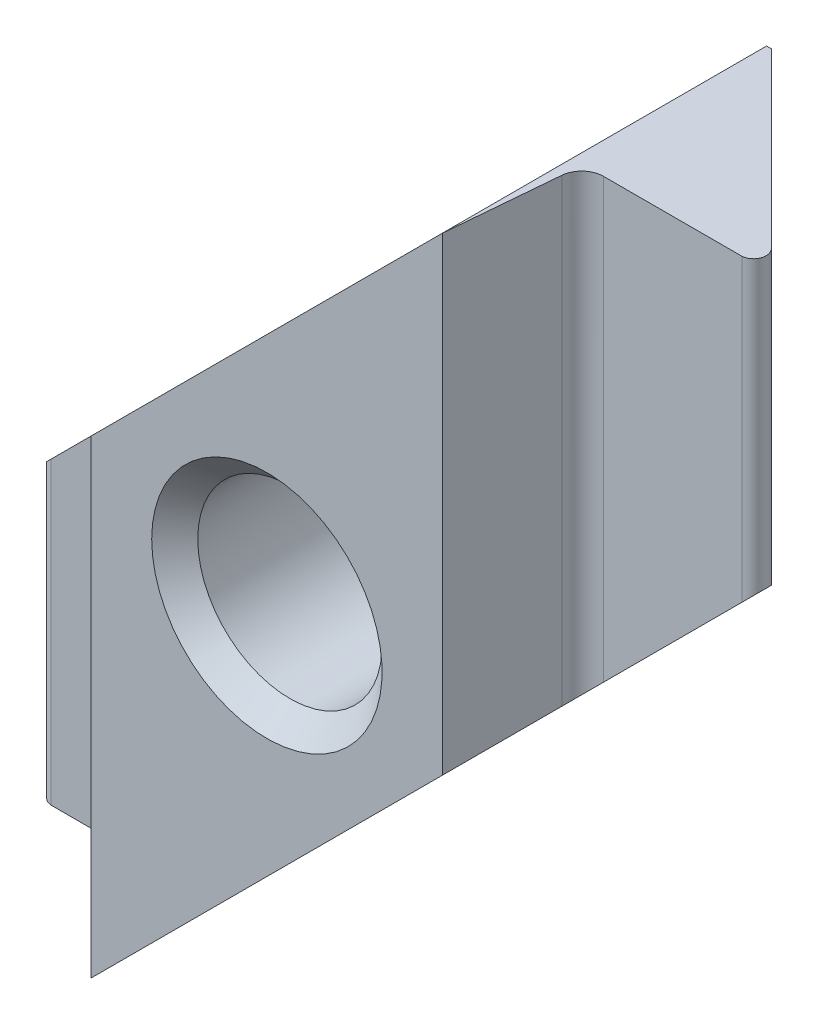
ISO-10303-21;
HEADER;
FILE_DESCRIPTION(('STEP AP214'),'2;1');
FILE_NAME('part.step','',(''),(''),'','','');
FILE_SCHEMA(('AUTOMOTIVE_DESIGN { 1 0 10303 214 1 1 1 1 }'));
ENDSEC;
DATA;
#1=APPLICATION_CONTEXT('core data for automotive mechanical design processes');
#2=APPLICATION_PROTOCOL_DEFINITION('international standard','automotive_design',2000,#1);
#3=PRODUCT_CONTEXT('',#1,'mechanical');
#4=PRODUCT('Part','Part','',(#3));
#5=PRODUCT_RELATED_PRODUCT_CATEGORY('part','',(#4));
#6=PRODUCT_DEFINITION_FORMATION('','',#4);
#7=PRODUCT_DEFINITION_CONTEXT('part definition',#1,'design');
#8=PRODUCT_DEFINITION('design','',#6,#7);
#9=PRODUCT_DEFINITION_SHAPE('','',#8);
#10=(LENGTH_UNIT() NAMED_UNIT(*) SI_UNIT(.MILLI.,.METRE.));
#11=(NAMED_UNIT(*) PLANE_ANGLE_UNIT() SI_UNIT($,.RADIAN.));
#12=(NAMED_UNIT(*) SI_UNIT($,.STERADIAN.) SOLID_ANGLE_UNIT());
#13=UNCERTAINTY_MEASURE_WITH_UNIT(LENGTH_MEASURE(1.E-05),#10,'distance_accuracy_value','');
#14=(GEOMETRIC_REPRESENTATION_CONTEXT(3) GLOBAL_UNCERTAINTY_ASSIGNED_CONTEXT((#13)) GLOBAL_UNIT_ASSIGNED_CONTEXT((#10,
#11,#12)) REPRESENTATION_CONTEXT('',''));
#15=CARTESIAN_POINT('',(0.,0.,0.));
#16=DIRECTION('',(0.,0.,1.));
#17=DIRECTION('',(1.,0.,0.));
#18=AXIS2_PLACEMENT_3D('',#15,#16,#17);
#19=CARTESIAN_POINT('',(-5.99967419969696,7.125,-3.66853808442258E-09));
#20=DIRECTION('',(0.,0.,1.));
#21=DIRECTION('',(1.,0.,0.));
#22=AXIS2_PLACEMENT_3D('',#19,#20,#21);
#23=PLANE('',#22);
#24=DIRECTION('',(1.,0.,0.));
#25=VECTOR('',#24,1.);
#26=CARTESIAN_POINT('',(-5.54445747646959E-09,7.125,0.));
#27=LINE('',#26,#25);
#28=CARTESIAN_POINT('',(5.99967418,7.125,1.04265318709613E-09));
#29=VERTEX_POINT('',#28);
#30=CARTESIAN_POINT('',(3.59047368385637,7.125,0.));
#31=VERTEX_POINT('',#30);
#32=EDGE_CURVE('E217',#29,#31,#27,.F.);
#33=ORIENTED_EDGE('',*,*,#32,.T.);
#34=DIRECTION('',(0.,-1.,0.));
#35=VECTOR('',#34,1.);
#36=CARTESIAN_POINT('',(3.59047368385637,7.125,-3.66853808442258E-09));
#37=LINE('',#36,#35);
#38=CARTESIAN_POINT('',(3.59047368385637,-0.48452631614363,0.));
#39=VERTEX_POINT('',#38);
#40=EDGE_CURVE('E61',#31,#39,#37,.T.);
#41=ORIENTED_EDGE('',*,*,#40,.T.);
#42=DIRECTION('',(0.707106781186547,0.707106781186548,0.));
#43=VECTOR('',#42,1.);
#44=CARTESIAN_POINT('',(2.25330085889911,-1.82169914110089,0.));
#45=LINE('',#44,#43);
#46=CARTESIAN_POINT('',(5.99967418,1.92467418000001,1.04265319130624E-09));
#47=VERTEX_POINT('',#46);
#48=EDGE_CURVE('E287',#47,#39,#45,.F.);
#49=ORIENTED_EDGE('',*,*,#48,.F.);
#50=DIRECTION('',(0.,1.,0.));
#51=VECTOR('',#50,1.);
#52=CARTESIAN_POINT('',(5.99967418,7.125,2.08530648304617E-09));
#53=LINE('',#52,#51);
#54=EDGE_CURVE('E337',#47,#29,#53,.T.);
#55=ORIENTED_EDGE('',*,*,#54,.T.);
#56=EDGE_LOOP('',(#33,#41,#49,#55));
#57=FACE_BOUND('',#56,.T.);
#58=ADVANCED_FACE('F40',(#57),#23,.T.);
#59=CARTESIAN_POINT('',(2.25330085889911,-1.82169914110089,0.));
#60=DIRECTION('',(0.707106781186548,-0.707106781186547,0.));
#61=DIRECTION('',(0.707106781186547,0.707106781186548,0.));
#62=AXIS2_PLACEMENT_3D('',#59,#60,#61);
#63=PLANE('',#62);
#64=ORIENTED_EDGE('',*,*,#48,.T.);
#65=CARTESIAN_POINT('',(3.59047368385637,-0.48452631614363,0.374999994246156));
#66=DIRECTION('',(0.707106781186548,-0.707106781186547,0.));
#67=DIRECTION('',(-0.707106781186547,-0.707106781186548,0.));
#68=AXIS2_PLACEMENT_3D('',#65,#66,#67);
#69=ELLIPSE('',#68,0.530330082940843,0.374999997914694);
#70=CARTESIAN_POINT('',(3.21690067413069,-0.858099325869309,0.342316591110638));
#71=VERTEX_POINT('',#70);
#72=EDGE_CURVE('E12',#39,#71,#69,.F.);
#73=ORIENTED_EDGE('',*,*,#72,.T.);
#74=DIRECTION('',(-0.0868265933023741,-0.0868265933023742,0.992432509237282));
#75=VECTOR('',#74,1.);
#76=CARTESIAN_POINT('',(3.23186905220776,-0.843130947792237,0.171227245678093));
#77=LINE('',#76,#75);
#78=CARTESIAN_POINT('',(3.05000000345213,-1.02500000034623,2.24999999886647));
#79=VERTEX_POINT('',#78);
#80=EDGE_CURVE('E183',#79,#71,#77,.F.);
#81=ORIENTED_EDGE('',*,*,#80,.F.);
#82=DIRECTION('',(0.707106782215891,0.707106780157204,0.));
#83=VECTOR('',#82,1.);
#84=CARTESIAN_POINT('',(3.05000000345213,-1.02500000034623,2.24999999886647));
#85=LINE('',#84,#83);
#86=CARTESIAN_POINT('',(-3.05000001,-7.12500001,2.25000006975162));
#87=VERTEX_POINT('',#86);
#88=EDGE_CURVE('E172',#87,#79,#85,.T.);
#89=ORIENTED_EDGE('',*,*,#88,.F.);
#90=DIRECTION('',(0.,0.,1.));
#91=VECTOR('',#90,1.);
#92=CARTESIAN_POINT('',(-3.05000001,-7.12500001,0.));
#93=LINE('',#92,#91);
#94=CARTESIAN_POINT('',(-3.05000000444444,-7.12500000444444,-3.375));
#95=VERTEX_POINT('',#94);
#96=EDGE_CURVE('E264',#87,#95,#93,.F.);
#97=ORIENTED_EDGE('',*,*,#96,.T.);
#98=DIRECTION('',(-0.707106781186547,-0.707106781186548,0.));
#99=VECTOR('',#98,1.);
#100=CARTESIAN_POINT('',(3.13229081,-0.942709189999997,-3.375));
#101=LINE('',#100,#99);
#102=CARTESIAN_POINT('',(3.13229081061589,-0.942709189384104,-3.375));
#103=VERTEX_POINT('',#102);
#104=EDGE_CURVE('E210',#103,#95,#101,.T.);
#105=ORIENTED_EDGE('',*,*,#104,.F.);
#106=DIRECTION('',(0.577327230017242,0.577327230017243,0.577396344776477));
#107=VECTOR('',#106,1.);
#108=CARTESIAN_POINT('',(3.13229081,-0.942709189999998,-3.375));
#109=LINE('',#108,#107);
#110=CARTESIAN_POINT('',(6.14824589800071,2.07324589800072,-0.358683856779772));
#111=VERTEX_POINT('',#110);
#112=EDGE_CURVE('E292',#103,#111,#109,.T.);
#113=ORIENTED_EDGE('',*,*,#112,.T.);
#114=CARTESIAN_POINT('',(5.98170294,1.90670294000001,-0.21755607));
#115=DIRECTION('',(0.707106781186548,-0.707106781186547,0.));
#116=DIRECTION('',(0.707106781186547,0.707106781186548,0.));
#117=AXIS2_PLACEMENT_3D('',#114,#115,#116);
#118=ELLIPSE('',#117,0.308718671482574,0.21829706608423);
#119=EDGE_CURVE('E377',#47,#111,#118,.F.);
#120=ORIENTED_EDGE('',*,*,#119,.F.);
#121=EDGE_LOOP('',(#64,#73,#81,#89,#97,#105,#113,#120));
#122=FACE_BOUND('',#121,.T.);
#123=ADVANCED_FACE('F330',(#122),#63,.T.);
#124=CARTESIAN_POINT('',(-2.25330085889911,1.82169914110089,0.));
#125=DIRECTION('',(0.707106781186548,-0.707106781186547,0.));
#126=DIRECTION('',(0.707106781186547,0.707106781186548,0.));
#127=AXIS2_PLACEMENT_3D('',#124,#125,#126);
#128=PLANE('',#127);
#129=DIRECTION('',(0.707106781186547,0.707106781186548,0.));
#130=VECTOR('',#129,1.);
#131=CARTESIAN_POINT('',(-2.25330085889911,1.82169914110089,0.));
#132=LINE('',#131,#130);
#133=CARTESIAN_POINT('',(-3.59047369660588,0.484526303394123,0.));
#134=VERTEX_POINT('',#133);
#135=CARTESIAN_POINT('',(-5.99967417749167,-1.92467417749168,-1.83426913765764E-09));
#136=VERTEX_POINT('',#135);
#137=EDGE_CURVE('E156',#134,#136,#132,.F.);
#138=ORIENTED_EDGE('',*,*,#137,.F.);
#139=CARTESIAN_POINT('',(-3.59047369660588,0.484526303394123,0.374999994246156));
#140=DIRECTION('',(0.707106781186548,-0.707106781186547,0.));
#141=DIRECTION('',(0.707106781186547,0.707106781186548,0.));
#142=AXIS2_PLACEMENT_3D('',#139,#140,#141);
#143=ELLIPSE('',#142,0.530330082940843,0.374999997914694);
#144=CARTESIAN_POINT('',(-3.2169006868802,0.858099313119803,0.342316591110639));
#145=VERTEX_POINT('',#144);
#146=EDGE_CURVE('E371',#134,#145,#143,.T.);
#147=ORIENTED_EDGE('',*,*,#146,.T.);
#148=DIRECTION('',(0.0868265933023741,0.0868265933023743,0.992432509237282));
#149=VECTOR('',#148,1.);
#150=CARTESIAN_POINT('',(-3.11144170312803,0.963558296871969,1.54771829911377));
#151=LINE('',#150,#149);
#152=CARTESIAN_POINT('',(-3.05000001620164,1.02499997999999,2.24999999886647));
#153=VERTEX_POINT('',#152);
#154=EDGE_CURVE('E164',#153,#145,#151,.F.);
#155=ORIENTED_EDGE('',*,*,#154,.F.);
#156=DIRECTION('',(-0.707106781186548,-0.707106781186547,0.));
#157=VECTOR('',#156,1.);
#158=CARTESIAN_POINT('',(-3.05000001620164,1.02499997999999,2.24999999886647));
#159=LINE('',#158,#157);
#160=CARTESIAN_POINT('',(3.05000000345213,7.12499999965377,2.24999999886647));
#161=VERTEX_POINT('',#160);
#162=EDGE_CURVE('E160',#161,#153,#159,.T.);
#163=ORIENTED_EDGE('',*,*,#162,.F.);
#164=DIRECTION('',(0.,0.,1.));
#165=VECTOR('',#164,1.);
#166=CARTESIAN_POINT('',(3.05,7.125,0.));
#167=LINE('',#166,#165);
#168=CARTESIAN_POINT('',(3.05,7.125,-3.375));
#169=VERTEX_POINT('',#168);
#170=EDGE_CURVE('E147',#169,#161,#167,.T.);
#171=ORIENTED_EDGE('',*,*,#170,.F.);
#172=DIRECTION('',(0.707106781186547,0.707106781186548,0.));
#173=VECTOR('',#172,1.);
#174=CARTESIAN_POINT('',(-2.25330085889911,1.82169914110089,-3.375));
#175=LINE('',#174,#173);
#176=CARTESIAN_POINT('',(-3.13229083,0.942709169999996,-3.375));
#177=VERTEX_POINT('',#176);
#178=EDGE_CURVE('E188',#177,#169,#175,.T.);
#179=ORIENTED_EDGE('',*,*,#178,.F.);
#180=DIRECTION('',(0.577327229074029,0.57732722907403,-0.577396346662677));
#181=VECTOR('',#180,1.);
#182=CARTESIAN_POINT('',(-6.14824591,-2.07324591000001,-0.35868385));
#183=LINE('',#182,#181);
#184=CARTESIAN_POINT('',(-6.14824591,-2.07324591,-0.358683850000006));
#185=VERTEX_POINT('',#184);
#186=EDGE_CURVE('E184',#185,#177,#183,.T.);
#187=ORIENTED_EDGE('',*,*,#186,.F.);
#188=CARTESIAN_POINT('',(-5.98170295,-1.90670295,-0.21755607));
#189=DIRECTION('',(0.707106781186548,-0.707106781186547,0.));
#190=DIRECTION('',(0.707106781186547,0.707106781186548,0.));
#191=AXIS2_PLACEMENT_3D('',#188,#189,#190);
#192=ELLIPSE('',#191,0.308718667441054,0.218297063226444);
#193=EDGE_CURVE('E243',#136,#185,#192,.T.);
#194=ORIENTED_EDGE('',*,*,#193,.F.);
#195=EDGE_LOOP('',(#138,#147,#155,#163,#171,#179,#187,#194));
#196=FACE_BOUND('',#195,.T.);
#197=ADVANCED_FACE('F162',(#196),#128,.F.);
#198=CARTESIAN_POINT('',(5.98170294,7.125,-0.21755607));
#199=DIRECTION('',(0.,1.,0.));
#200=DIRECTION('',(0.,0.,1.));
#201=AXIS2_PLACEMENT_3D('',#198,#199,#200);
#202=CYLINDRICAL_SURFACE('',#201,0.21829706608423);
#203=CARTESIAN_POINT('',(5.98170294,7.125,-0.21755607));
#204=DIRECTION('',(0.,1.,0.));
#205=DIRECTION('',(0.,0.,1.));
#206=AXIS2_PLACEMENT_3D('',#203,#204,#205);
#207=CIRCLE('',#206,0.21829706608423);
#208=CARTESIAN_POINT('',(6.14824589800071,7.125,-0.358683856779766));
#209=VERTEX_POINT('',#208);
#210=EDGE_CURVE('E392',#209,#29,#207,.F.);
#211=ORIENTED_EDGE('',*,*,#210,.T.);
#212=ORIENTED_EDGE('',*,*,#54,.F.);
#213=ORIENTED_EDGE('',*,*,#119,.T.);
#214=DIRECTION('',(0.,1.,0.));
#215=VECTOR('',#214,1.);
#216=CARTESIAN_POINT('',(6.14824589800071,7.125,-0.358683856779769));
#217=LINE('',#216,#215);
#218=EDGE_CURVE('E242',#209,#111,#217,.F.);
#219=ORIENTED_EDGE('',*,*,#218,.F.);
#220=EDGE_LOOP('',(#211,#212,#213,#219));
#221=FACE_BOUND('',#220,.T.);
#222=ADVANCED_FACE('F402',(#221),#202,.T.);
#223=CARTESIAN_POINT('',(-5.54445767075862E-09,-7.125,-0.581507787179232));
#224=DIRECTION('',(0.,-1.,0.));
#225=DIRECTION('',(0.,0.,-1.));
#226=AXIS2_PLACEMENT_3D('',#223,#224,#225);
#227=PLANE('',#226);
#228=DIRECTION('',(-0.707064455058227,0.,0.707149104781454));
#229=VECTOR('',#228,1.);
#230=CARTESIAN_POINT('',(-3.13229083,-7.125,-3.375));
#231=LINE('',#230,#229);
#232=CARTESIAN_POINT('',(-3.13229083,-7.125,-3.375));
#233=VERTEX_POINT('',#232);
#234=CARTESIAN_POINT('',(-6.14824591,-7.125,-0.358683850000005));
#235=VERTEX_POINT('',#234);
#236=EDGE_CURVE('E263',#233,#235,#231,.T.);
#237=ORIENTED_EDGE('',*,*,#236,.F.);
#238=DIRECTION('',(1.,0.,0.));
#239=VECTOR('',#238,1.);
#240=CARTESIAN_POINT('',(-5.54445767075862E-09,-7.125,-3.375));
#241=LINE('',#240,#239);
#242=EDGE_CURVE('E256',#233,#95,#241,.T.);
#243=ORIENTED_EDGE('',*,*,#242,.T.);
#244=ORIENTED_EDGE('',*,*,#96,.F.);
#245=DIRECTION('',(-0.0871557421793705,0.,-0.996194698141464));
#246=VECTOR('',#245,1.);
#247=CARTESIAN_POINT('',(-3.272674921724,-7.125,-0.295185834489084));
#248=LINE('',#247,#246);
#249=CARTESIAN_POINT('',(-3.2169006868802,-7.125,0.342316591110638));
#250=VERTEX_POINT('',#249);
#251=EDGE_CURVE('E144',#250,#87,#248,.F.);
#252=ORIENTED_EDGE('',*,*,#251,.F.);
#253=CARTESIAN_POINT('',(-3.59047369660588,-7.125,0.374999994246156));
#254=DIRECTION('',(0.,-1.,0.));
#255=DIRECTION('',(0.,0.,-1.));
#256=AXIS2_PLACEMENT_3D('',#253,#254,#255);
#257=CIRCLE('',#256,0.374999997914694);
#258=CARTESIAN_POINT('',(-3.59047369660588,-7.125,-3.66853808442258E-09));
#259=VERTEX_POINT('',#258);
#260=EDGE_CURVE('E369',#250,#259,#257,.F.);
#261=ORIENTED_EDGE('',*,*,#260,.T.);
#262=DIRECTION('',(1.,0.,0.));
#263=VECTOR('',#262,1.);
#264=CARTESIAN_POINT('',(-5.99967419969696,-7.125,-3.66853808442258E-09));
#265=LINE('',#264,#263);
#266=CARTESIAN_POINT('',(-5.99967419969696,-7.125,-3.66853807986893E-09));
#267=VERTEX_POINT('',#266);
#268=EDGE_CURVE('E216',#267,#259,#265,.T.);
#269=ORIENTED_EDGE('',*,*,#268,.F.);
#270=CARTESIAN_POINT('',(-5.98170295,-7.125,-0.21755607));
#271=DIRECTION('',(0.,1.,0.));
#272=DIRECTION('',(0.,0.,1.));
#273=AXIS2_PLACEMENT_3D('',#270,#271,#272);
#274=CIRCLE('',#273,0.218297063226444);
#275=EDGE_CURVE('E237',#235,#267,#274,.T.);
#276=ORIENTED_EDGE('',*,*,#275,.F.);
#277=EDGE_LOOP('',(#237,#243,#244,#252,#261,#269,#276));
#278=FACE_BOUND('',#277,.T.);
#279=ADVANCED_FACE('F339',(#278),#227,.T.);
#280=CARTESIAN_POINT('',(-5.98170295,7.125,-0.21755607));
#281=DIRECTION('',(0.,1.,0.));
#282=DIRECTION('',(0.,0.,1.));
#283=AXIS2_PLACEMENT_3D('',#280,#281,#282);
#284=CYLINDRICAL_SURFACE('',#283,0.218297063226444);
#285=ORIENTED_EDGE('',*,*,#275,.T.);
#286=DIRECTION('',(0.,1.,0.));
#287=VECTOR('',#286,1.);
#288=CARTESIAN_POINT('',(-5.99967419969696,7.125,-3.66853808442258E-09));
#289=LINE('',#288,#287);
#290=EDGE_CURVE('E213',#136,#267,#289,.F.);
#291=ORIENTED_EDGE('',*,*,#290,.F.);
#292=ORIENTED_EDGE('',*,*,#193,.T.);
#293=DIRECTION('',(0.,1.,0.));
#294=VECTOR('',#293,1.);
#295=CARTESIAN_POINT('',(-6.14824591,7.125,-0.358683850000001));
#296=LINE('',#295,#294);
#297=EDGE_CURVE('E308',#235,#185,#296,.T.);
#298=ORIENTED_EDGE('',*,*,#297,.F.);
#299=EDGE_LOOP('',(#285,#291,#292,#298));
#300=FACE_BOUND('',#299,.T.);
#301=ADVANCED_FACE('F382',(#300),#284,.T.);
#302=CARTESIAN_POINT('',(6.14824589800071,7.125,-0.358683856779769));
#303=DIRECTION('',(0.707149104781454,0.,-0.707064455058227));
#304=DIRECTION('',(-0.707064455058227,0.,-0.707149104781454));
#305=AXIS2_PLACEMENT_3D('',#302,#303,#304);
#306=PLANE('',#305);
#307=DIRECTION('',(0.707064456790917,0.,0.707149103048972));
#308=VECTOR('',#307,1.);
#309=CARTESIAN_POINT('',(3.13229081,7.125,-3.375));
#310=LINE('',#309,#308);
#311=CARTESIAN_POINT('',(3.13229081,7.125,-3.375));
#312=VERTEX_POINT('',#311);
#313=EDGE_CURVE('E316',#312,#209,#310,.T.);
#314=ORIENTED_EDGE('',*,*,#313,.T.);
#315=ORIENTED_EDGE('',*,*,#218,.T.);
#316=ORIENTED_EDGE('',*,*,#112,.F.);
#317=DIRECTION('',(0.,1.,0.));
#318=VECTOR('',#317,1.);
#319=CARTESIAN_POINT('',(3.13229081,7.125,-3.375));
#320=LINE('',#319,#318);
#321=EDGE_CURVE('E298',#312,#103,#320,.F.);
#322=ORIENTED_EDGE('',*,*,#321,.F.);
#323=EDGE_LOOP('',(#314,#315,#316,#322));
#324=FACE_BOUND('',#323,.T.);
#325=ADVANCED_FACE('F474',(#324),#306,.T.);
#326=CARTESIAN_POINT('',(-5.54445747646959E-09,7.125,-0.581507787179232));
#327=DIRECTION('',(0.,-1.,0.));
#328=DIRECTION('',(0.,0.,-1.));
#329=AXIS2_PLACEMENT_3D('',#326,#327,#328);
#330=PLANE('',#329);
#331=ORIENTED_EDGE('',*,*,#170,.T.);
#332=DIRECTION('',(0.0871557421793705,0.,-0.996194698141464));
#333=VECTOR('',#332,1.);
#334=CARTESIAN_POINT('',(3.05000000345213,7.125,2.24999999886647));
#335=LINE('',#334,#333);
#336=CARTESIAN_POINT('',(3.21690067413069,7.125,0.342316591110639));
#337=VERTEX_POINT('',#336);
#338=EDGE_CURVE('E135',#337,#161,#335,.F.);
#339=ORIENTED_EDGE('',*,*,#338,.F.);
#340=CARTESIAN_POINT('',(3.59047368385637,7.125,0.374999994246156));
#341=DIRECTION('',(0.,-1.,0.));
#342=DIRECTION('',(0.,0.,-1.));
#343=AXIS2_PLACEMENT_3D('',#340,#341,#342);
#344=CIRCLE('',#343,0.374999997914694);
#345=EDGE_CURVE('E48',#337,#31,#344,.T.);
#346=ORIENTED_EDGE('',*,*,#345,.T.);
#347=ORIENTED_EDGE('',*,*,#32,.F.);
#348=ORIENTED_EDGE('',*,*,#210,.F.);
#349=ORIENTED_EDGE('',*,*,#313,.F.);
#350=DIRECTION('',(-1.,0.,0.));
#351=VECTOR('',#350,1.);
#352=CARTESIAN_POINT('',(-1.00000008274037E-08,7.125,-3.375));
#353=LINE('',#352,#351);
#354=EDGE_CURVE('E151',#169,#312,#353,.F.);
#355=ORIENTED_EDGE('',*,*,#354,.F.);
#356=EDGE_LOOP('',(#331,#339,#346,#347,#348,#349,#355));
#357=FACE_BOUND('',#356,.T.);
#358=ADVANCED_FACE('F149',(#357),#330,.F.);
#359=ORIENTED_EDGE('',*,*,#268,.T.);
#360=DIRECTION('',(0.,1.,0.));
#361=VECTOR('',#360,1.);
#362=CARTESIAN_POINT('',(-3.59047369660588,7.125,-3.66853808442258E-09));
#363=LINE('',#362,#361);
#364=EDGE_CURVE('E365',#259,#134,#363,.T.);
#365=ORIENTED_EDGE('',*,*,#364,.T.);
#366=ORIENTED_EDGE('',*,*,#137,.T.);
#367=ORIENTED_EDGE('',*,*,#290,.T.);
#368=EDGE_LOOP('',(#359,#365,#366,#367));
#369=FACE_BOUND('',#368,.T.);
#370=ADVANCED_FACE('F380',(#369),#23,.T.);
#371=CARTESIAN_POINT('',(-3.13229083,7.125,-3.375));
#372=DIRECTION('',(-0.707149104781454,0.,-0.707064455058227));
#373=DIRECTION('',(-0.707064455058227,0.,0.707149104781454));
#374=AXIS2_PLACEMENT_3D('',#371,#372,#373);
#375=PLANE('',#374);
#376=ORIENTED_EDGE('',*,*,#236,.T.);
#377=ORIENTED_EDGE('',*,*,#297,.T.);
#378=ORIENTED_EDGE('',*,*,#186,.T.);
#379=DIRECTION('',(0.,1.,0.));
#380=VECTOR('',#379,1.);
#381=CARTESIAN_POINT('',(-3.13229083,7.125,-3.375));
#382=LINE('',#381,#380);
#383=EDGE_CURVE('E157',#233,#177,#382,.T.);
#384=ORIENTED_EDGE('',*,*,#383,.F.);
#385=EDGE_LOOP('',(#376,#377,#378,#384));
#386=FACE_BOUND('',#385,.T.);
#387=ADVANCED_FACE('F344',(#386),#375,.T.);
#388=CARTESIAN_POINT('',(-1.00000008274037E-08,7.125,-3.375));
#389=DIRECTION('',(0.,0.,-1.));
#390=DIRECTION('',(-1.,0.,0.));
#391=AXIS2_PLACEMENT_3D('',#388,#389,#390);
#392=PLANE('',#391);
#393=CARTESIAN_POINT('',(0.,0.,-3.375));
#394=DIRECTION('',(0.,0.,-1.));
#395=DIRECTION('',(-1.,0.,0.));
#396=AXIS2_PLACEMENT_3D('',#393,#394,#395);
#397=CIRCLE('',#396,1.99500000007356);
#398=CARTESIAN_POINT('',(-1.99500000007356,0.,-3.375));
#399=VERTEX_POINT('',#398);
#400=EDGE_CURVE('E174',#399,#399,#397,.T.);
#401=ORIENTED_EDGE('',*,*,#400,.F.);
#402=EDGE_LOOP('',(#401));
#403=FACE_BOUND('',#402,.T.);
#404=ORIENTED_EDGE('',*,*,#242,.F.);
#405=ORIENTED_EDGE('',*,*,#383,.T.);
#406=ORIENTED_EDGE('',*,*,#178,.T.);
#407=ORIENTED_EDGE('',*,*,#354,.T.);
#408=ORIENTED_EDGE('',*,*,#321,.T.);
#409=ORIENTED_EDGE('',*,*,#104,.T.);
#410=EDGE_LOOP('',(#404,#405,#406,#407,#408,#409));
#411=FACE_BOUND('',#410,.T.);
#412=ADVANCED_FACE('F333',(#403,#411),#392,.T.);
#413=CARTESIAN_POINT('',(3.05000000345213,7.12499999965377,2.24999999886647));
#414=DIRECTION('',(0.996194698141464,0.,0.0871557421793705));
#415=DIRECTION('',(0.0871557421793705,0.,-0.996194698141464));
#416=AXIS2_PLACEMENT_3D('',#413,#414,#415);
#417=PLANE('',#416);
#418=ORIENTED_EDGE('',*,*,#80,.T.);
#419=DIRECTION('',(0.,1.,0.));
#420=VECTOR('',#419,1.);
#421=CARTESIAN_POINT('',(3.21690067413069,7.12499999965377,0.342316591110639));
#422=LINE('',#421,#420);
#423=EDGE_CURVE('E142',#71,#337,#422,.T.);
#424=ORIENTED_EDGE('',*,*,#423,.T.);
#425=ORIENTED_EDGE('',*,*,#338,.T.);
#426=DIRECTION('',(0.,1.,0.));
#427=VECTOR('',#426,1.);
#428=CARTESIAN_POINT('',(3.05000000345213,7.12499999965377,2.24999999886647));
#429=LINE('',#428,#427);
#430=EDGE_CURVE('E140',#79,#161,#429,.T.);
#431=ORIENTED_EDGE('',*,*,#430,.F.);
#432=EDGE_LOOP('',(#418,#424,#425,#431));
#433=FACE_BOUND('',#432,.T.);
#434=ADVANCED_FACE('F138',(#433),#417,.T.);
#435=CARTESIAN_POINT('',(-3.05000001620164,-7.12500000224033,2.24999999886647));
#436=DIRECTION('',(-0.996194698141464,0.,0.0871557421793705));
#437=DIRECTION('',(0.0871557421793705,0.,0.996194698141464));
#438=AXIS2_PLACEMENT_3D('',#435,#436,#437);
#439=PLANE('',#438);
#440=ORIENTED_EDGE('',*,*,#154,.T.);
#441=DIRECTION('',(0.,-1.,0.));
#442=VECTOR('',#441,1.);
#443=CARTESIAN_POINT('',(-3.2169006868802,-7.12500000224033,0.342316591110639));
#444=LINE('',#443,#442);
#445=EDGE_CURVE('E363',#145,#250,#444,.T.);
#446=ORIENTED_EDGE('',*,*,#445,.T.);
#447=ORIENTED_EDGE('',*,*,#251,.T.);
#448=DIRECTION('',(0.,-1.,0.));
#449=VECTOR('',#448,1.);
#450=CARTESIAN_POINT('',(-3.05000001620164,-7.12500000224033,2.24999999886647));
#451=LINE('',#450,#449);
#452=EDGE_CURVE('E168',#153,#87,#451,.T.);
#453=ORIENTED_EDGE('',*,*,#452,.F.);
#454=EDGE_LOOP('',(#440,#446,#447,#453));
#455=FACE_BOUND('',#454,.T.);
#456=ADVANCED_FACE('F376',(#455),#439,.T.);
#457=CARTESIAN_POINT('',(0.,0.,2.24999999886647));
#458=DIRECTION('',(0.,0.,-1.));
#459=DIRECTION('',(-1.,0.,0.));
#460=AXIS2_PLACEMENT_3D('',#457,#458,#459);
#461=PLANE('',#460);
#462=CARTESIAN_POINT('',(0.,0.,2.24999999886647));
#463=DIRECTION('',(0.,0.,-1.));
#464=DIRECTION('',(-1.,0.,0.));
#465=AXIS2_PLACEMENT_3D('',#462,#463,#464);
#466=CIRCLE('',#465,1.99999999890604);
#467=CARTESIAN_POINT('',(-1.99999999890604,0.,2.24999999886647));
#468=VERTEX_POINT('',#467);
#469=EDGE_CURVE('E143',#468,#468,#466,.T.);
#470=ORIENTED_EDGE('',*,*,#469,.T.);
#471=EDGE_LOOP('',(#470));
#472=FACE_BOUND('',#471,.T.);
#473=ORIENTED_EDGE('',*,*,#430,.T.);
#474=ORIENTED_EDGE('',*,*,#162,.T.);
#475=ORIENTED_EDGE('',*,*,#452,.T.);
#476=ORIENTED_EDGE('',*,*,#88,.T.);
#477=EDGE_LOOP('',(#473,#474,#475,#476));
#478=FACE_BOUND('',#477,.T.);
#479=ADVANCED_FACE('F170',(#472,#478),#461,.F.);
#480=CARTESIAN_POINT('',(0.,0.,2.25));
#481=DIRECTION('',(0.,0.,-1.));
#482=DIRECTION('',(-1.,0.,0.));
#483=AXIS2_PLACEMENT_3D('',#480,#481,#482);
#484=CYLINDRICAL_SURFACE('',#483,1.60000000002656);
#485=CARTESIAN_POINT('',(0.,0.,1.84999999998699));
#486=DIRECTION('',(0.,0.,-1.));
#487=DIRECTION('',(-1.,0.,0.));
#488=AXIS2_PLACEMENT_3D('',#485,#486,#487);
#489=CIRCLE('',#488,1.60000000002656);
#490=CARTESIAN_POINT('',(-1.60000000002656,0.,1.84999999998699));
#491=VERTEX_POINT('',#490);
#492=EDGE_CURVE('E360',#491,#491,#489,.F.);
#493=ORIENTED_EDGE('',*,*,#492,.T.);
#494=EDGE_LOOP('',(#493));
#495=FACE_BOUND('',#494,.T.);
#496=CARTESIAN_POINT('',(0.,0.,-2.979999999953));
#497=DIRECTION('',(0.,0.,-1.));
#498=DIRECTION('',(-1.,0.,0.));
#499=AXIS2_PLACEMENT_3D('',#496,#497,#498);
#500=CIRCLE('',#499,1.60000000002656);
#501=CARTESIAN_POINT('',(-1.60000000002656,0.,-2.979999999953));
#502=VERTEX_POINT('',#501);
#503=EDGE_CURVE('E177',#502,#502,#500,.T.);
#504=ORIENTED_EDGE('',*,*,#503,.T.);
#505=EDGE_LOOP('',(#504));
#506=FACE_BOUND('',#505,.T.);
#507=ADVANCED_FACE('F557',(#495,#506),#484,.F.);
#508=CARTESIAN_POINT('',(0.,0.,-3.375));
#509=DIRECTION('',(0.,0.,-1.));
#510=DIRECTION('',(-1.,0.,0.));
#511=AXIS2_PLACEMENT_3D('',#508,#509,#510);
#512=CONICAL_SURFACE('',#511,1.99500000007356,0.785398163397449);
#513=ORIENTED_EDGE('',*,*,#503,.F.);
#514=EDGE_LOOP('',(#513));
#515=FACE_BOUND('',#514,.T.);
#516=ORIENTED_EDGE('',*,*,#400,.T.);
#517=EDGE_LOOP('',(#516));
#518=FACE_BOUND('',#517,.T.);
#519=ADVANCED_FACE('F553',(#515,#518),#512,.F.);
#520=CARTESIAN_POINT('',(0.,0.,2.24999999886647));
#521=DIRECTION('',(0.,0.,1.));
#522=DIRECTION('',(1.,0.,0.));
#523=AXIS2_PLACEMENT_3D('',#520,#521,#522);
#524=CONICAL_SURFACE('',#523,1.99999999890604,0.785398163397444);
#525=ORIENTED_EDGE('',*,*,#492,.F.);
#526=EDGE_LOOP('',(#525));
#527=FACE_BOUND('',#526,.T.);
#528=ORIENTED_EDGE('',*,*,#469,.F.);
#529=EDGE_LOOP('',(#528));
#530=FACE_BOUND('',#529,.T.);
#531=ADVANCED_FACE('F444',(#527,#530),#524,.F.);
#532=CARTESIAN_POINT('',(-3.59047369660588,-7.12500000224033,0.374999994246156));
#533=DIRECTION('',(0.,1.,0.));
#534=DIRECTION('',(0.,0.,1.));
#535=AXIS2_PLACEMENT_3D('',#532,#533,#534);
#536=CYLINDRICAL_SURFACE('',#535,0.374999997914694);
#537=ORIENTED_EDGE('',*,*,#146,.F.);
#538=ORIENTED_EDGE('',*,*,#364,.F.);
#539=ORIENTED_EDGE('',*,*,#260,.F.);
#540=ORIENTED_EDGE('',*,*,#445,.F.);
#541=EDGE_LOOP('',(#537,#538,#539,#540));
#542=FACE_BOUND('',#541,.T.);
#543=ADVANCED_FACE('F378',(#542),#536,.F.);
#544=CARTESIAN_POINT('',(3.59047368385637,7.12499999965377,0.374999994246156));
#545=DIRECTION('',(0.,-1.,0.));
#546=DIRECTION('',(1.,0.,0.));
#547=AXIS2_PLACEMENT_3D('',#544,#545,#546);
#548=CYLINDRICAL_SURFACE('',#547,0.374999997914694);
#549=ORIENTED_EDGE('',*,*,#72,.F.);
#550=ORIENTED_EDGE('',*,*,#40,.F.);
#551=ORIENTED_EDGE('',*,*,#345,.F.);
#552=ORIENTED_EDGE('',*,*,#423,.F.);
#553=EDGE_LOOP('',(#549,#550,#551,#552));
#554=FACE_BOUND('',#553,.T.);
#555=ADVANCED_FACE('F42',(#554),#548,.F.);
#556=CLOSED_SHELL('',(#58,#123,#197,#222,#279,#301,#325,#358,#370,#387,#412,#434,#456,#479,#507,
#519,#531,#543,#555));
#557=MANIFOLD_SOLID_BREP('B2',#556);
#558=ADVANCED_BREP_SHAPE_REPRESENTATION('',(#18,#557),#14);
#559=SHAPE_DEFINITION_REPRESENTATION(#9,#558);
ENDSEC;
END-ISO-10303-21;
